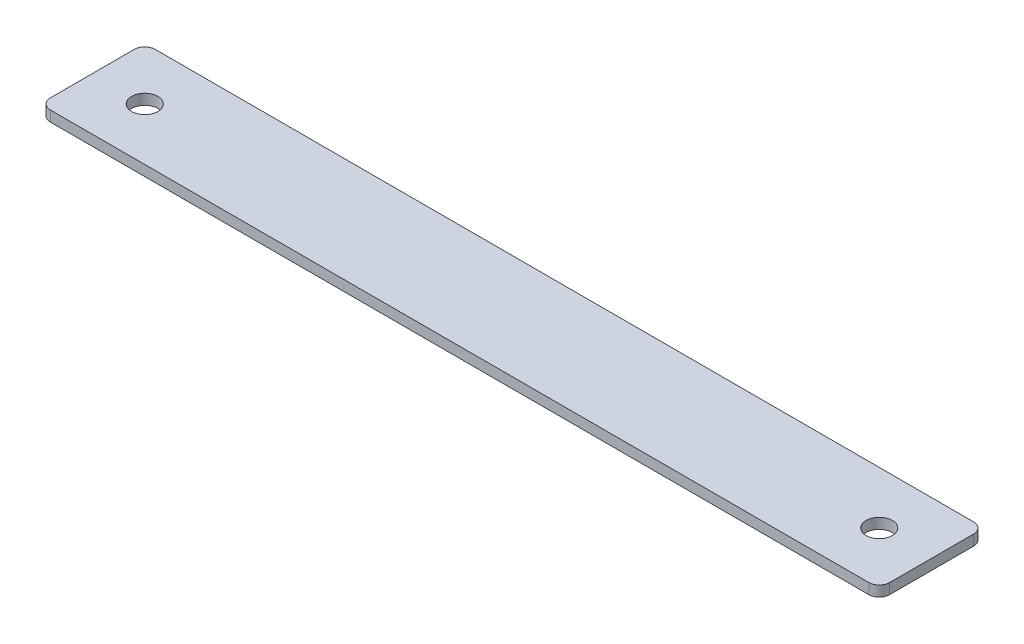
ISO-10303-21;
HEADER;
FILE_DESCRIPTION(('STEP AP214'),'2;1');
FILE_NAME('part.step','',(''),(''),'','','');
FILE_SCHEMA(('AUTOMOTIVE_DESIGN { 1 0 10303 214 1 1 1 1 }'));
ENDSEC;
DATA;
#1=APPLICATION_CONTEXT('core data for automotive mechanical design processes');
#2=APPLICATION_PROTOCOL_DEFINITION('international standard','automotive_design',2000,#1);
#3=PRODUCT_CONTEXT('',#1,'mechanical');
#4=PRODUCT('Part','Part','',(#3));
#5=PRODUCT_RELATED_PRODUCT_CATEGORY('part','',(#4));
#6=PRODUCT_DEFINITION_FORMATION('','',#4);
#7=PRODUCT_DEFINITION_CONTEXT('part definition',#1,'design');
#8=PRODUCT_DEFINITION('design','',#6,#7);
#9=PRODUCT_DEFINITION_SHAPE('','',#8);
#10=(LENGTH_UNIT() NAMED_UNIT(*) SI_UNIT(.MILLI.,.METRE.));
#11=(NAMED_UNIT(*) PLANE_ANGLE_UNIT() SI_UNIT($,.RADIAN.));
#12=(NAMED_UNIT(*) SI_UNIT($,.STERADIAN.) SOLID_ANGLE_UNIT());
#13=UNCERTAINTY_MEASURE_WITH_UNIT(LENGTH_MEASURE(1.E-05),#10,'distance_accuracy_value','');
#14=(GEOMETRIC_REPRESENTATION_CONTEXT(3) GLOBAL_UNCERTAINTY_ASSIGNED_CONTEXT((#13)) GLOBAL_UNIT_ASSIGNED_CONTEXT((#10,
#11,#12)) REPRESENTATION_CONTEXT('',''));
#15=CARTESIAN_POINT('',(0.,0.,0.));
#16=DIRECTION('',(0.,0.,1.));
#17=DIRECTION('',(1.,0.,0.));
#18=AXIS2_PLACEMENT_3D('',#15,#16,#17);
#19=CARTESIAN_POINT('',(78.,-2.,-8.00000000000004));
#20=DIRECTION('',(0.,1.,0.));
#21=DIRECTION('',(0.,0.,1.));
#22=AXIS2_PLACEMENT_3D('',#19,#20,#21);
#23=CYLINDRICAL_SURFACE('',#22,2.);
#24=CARTESIAN_POINT('',(78.,0.,-8.00000000000004));
#25=DIRECTION('',(0.,1.,0.));
#26=DIRECTION('',(0.,0.,-1.));
#27=AXIS2_PLACEMENT_3D('',#24,#25,#26);
#28=CIRCLE('',#27,2.);
#29=CARTESIAN_POINT('',(80.,0.,-8.00000000000003));
#30=VERTEX_POINT('',#29);
#31=CARTESIAN_POINT('',(78.,0.,-10.));
#32=VERTEX_POINT('',#31);
#33=EDGE_CURVE('E135',#30,#32,#28,.T.);
#34=ORIENTED_EDGE('',*,*,#33,.F.);
#35=DIRECTION('',(0.,1.,0.));
#36=VECTOR('',#35,1.);
#37=CARTESIAN_POINT('',(80.,-2.,-8.00000000000003));
#38=LINE('',#37,#36);
#39=CARTESIAN_POINT('',(80.,-2.,-8.00000000000003));
#40=VERTEX_POINT('',#39);
#41=EDGE_CURVE('E11',#40,#30,#38,.T.);
#42=ORIENTED_EDGE('',*,*,#41,.F.);
#43=CARTESIAN_POINT('',(78.,-2.,-8.00000000000004));
#44=DIRECTION('',(0.,1.,0.));
#45=DIRECTION('',(0.,0.,-1.));
#46=AXIS2_PLACEMENT_3D('',#43,#44,#45);
#47=CIRCLE('',#46,2.);
#48=CARTESIAN_POINT('',(78.,-2.,-10.));
#49=VERTEX_POINT('',#48);
#50=EDGE_CURVE('E156',#40,#49,#47,.T.);
#51=ORIENTED_EDGE('',*,*,#50,.T.);
#52=DIRECTION('',(0.,1.,0.));
#53=VECTOR('',#52,1.);
#54=CARTESIAN_POINT('',(78.,-2.,-10.));
#55=LINE('',#54,#53);
#56=EDGE_CURVE('E41',#49,#32,#55,.T.);
#57=ORIENTED_EDGE('',*,*,#56,.T.);
#58=EDGE_LOOP('',(#34,#42,#51,#57));
#59=FACE_BOUND('',#58,.T.);
#60=ADVANCED_FACE('F38',(#59),#23,.T.);
#61=CARTESIAN_POINT('',(80.,-2.,-8.00000000000003));
#62=DIRECTION('',(1.,0.,0.));
#63=DIRECTION('',(0.,0.,-1.));
#64=AXIS2_PLACEMENT_3D('',#61,#62,#63);
#65=PLANE('',#64);
#66=DIRECTION('',(0.,0.,-1.));
#67=VECTOR('',#66,1.);
#68=CARTESIAN_POINT('',(80.,0.,-8.00000000000003));
#69=LINE('',#68,#67);
#70=CARTESIAN_POINT('',(80.,0.,7.99999999999998));
#71=VERTEX_POINT('',#70);
#72=EDGE_CURVE('E154',#71,#30,#69,.T.);
#73=ORIENTED_EDGE('',*,*,#72,.F.);
#74=DIRECTION('',(0.,1.,0.));
#75=VECTOR('',#74,1.);
#76=CARTESIAN_POINT('',(80.,-2.,7.99999999999998));
#77=LINE('',#76,#75);
#78=CARTESIAN_POINT('',(80.,-2.,7.99999999999998));
#79=VERTEX_POINT('',#78);
#80=EDGE_CURVE('E47',#79,#71,#77,.T.);
#81=ORIENTED_EDGE('',*,*,#80,.F.);
#82=DIRECTION('',(0.,0.,-1.));
#83=VECTOR('',#82,1.);
#84=CARTESIAN_POINT('',(80.,-2.,-8.00000000000003));
#85=LINE('',#84,#83);
#86=EDGE_CURVE('E125',#79,#40,#85,.T.);
#87=ORIENTED_EDGE('',*,*,#86,.T.);
#88=ORIENTED_EDGE('',*,*,#41,.T.);
#89=EDGE_LOOP('',(#73,#81,#87,#88));
#90=FACE_BOUND('',#89,.T.);
#91=ADVANCED_FACE('F168',(#90),#65,.T.);
#92=CARTESIAN_POINT('',(78.,-2.,8.));
#93=DIRECTION('',(0.,1.,0.));
#94=DIRECTION('',(0.,0.,1.));
#95=AXIS2_PLACEMENT_3D('',#92,#93,#94);
#96=CYLINDRICAL_SURFACE('',#95,2.);
#97=CARTESIAN_POINT('',(78.,0.,8.));
#98=DIRECTION('',(0.,1.,0.));
#99=DIRECTION('',(0.,0.,-1.));
#100=AXIS2_PLACEMENT_3D('',#97,#98,#99);
#101=CIRCLE('',#100,2.);
#102=CARTESIAN_POINT('',(78.,0.,10.));
#103=VERTEX_POINT('',#102);
#104=EDGE_CURVE('E112',#103,#71,#101,.T.);
#105=ORIENTED_EDGE('',*,*,#104,.F.);
#106=DIRECTION('',(0.,1.,0.));
#107=VECTOR('',#106,1.);
#108=CARTESIAN_POINT('',(78.,-2.,10.));
#109=LINE('',#108,#107);
#110=CARTESIAN_POINT('',(78.,-2.,10.));
#111=VERTEX_POINT('',#110);
#112=EDGE_CURVE('E107',#111,#103,#109,.T.);
#113=ORIENTED_EDGE('',*,*,#112,.F.);
#114=CARTESIAN_POINT('',(78.,-2.,8.));
#115=DIRECTION('',(0.,1.,0.));
#116=DIRECTION('',(0.,0.,-1.));
#117=AXIS2_PLACEMENT_3D('',#114,#115,#116);
#118=CIRCLE('',#117,2.);
#119=EDGE_CURVE('E110',#111,#79,#118,.T.);
#120=ORIENTED_EDGE('',*,*,#119,.T.);
#121=ORIENTED_EDGE('',*,*,#80,.T.);
#122=EDGE_LOOP('',(#105,#113,#120,#121));
#123=FACE_BOUND('',#122,.T.);
#124=ADVANCED_FACE('F109',(#123),#96,.T.);
#125=CARTESIAN_POINT('',(78.,-2.,10.));
#126=DIRECTION('',(0.,0.,1.));
#127=DIRECTION('',(1.,0.,0.));
#128=AXIS2_PLACEMENT_3D('',#125,#126,#127);
#129=PLANE('',#128);
#130=DIRECTION('',(1.,0.,0.));
#131=VECTOR('',#130,1.);
#132=CARTESIAN_POINT('',(78.,0.,10.));
#133=LINE('',#132,#131);
#134=CARTESIAN_POINT('',(-78.,0.,10.));
#135=VERTEX_POINT('',#134);
#136=EDGE_CURVE('E151',#135,#103,#133,.T.);
#137=ORIENTED_EDGE('',*,*,#136,.F.);
#138=DIRECTION('',(0.,1.,0.));
#139=VECTOR('',#138,1.);
#140=CARTESIAN_POINT('',(-78.,-2.,10.));
#141=LINE('',#140,#139);
#142=CARTESIAN_POINT('',(-78.,-2.,10.));
#143=VERTEX_POINT('',#142);
#144=EDGE_CURVE('E117',#143,#135,#141,.T.);
#145=ORIENTED_EDGE('',*,*,#144,.F.);
#146=DIRECTION('',(1.,0.,0.));
#147=VECTOR('',#146,1.);
#148=CARTESIAN_POINT('',(78.,-2.,10.));
#149=LINE('',#148,#147);
#150=EDGE_CURVE('E123',#143,#111,#149,.T.);
#151=ORIENTED_EDGE('',*,*,#150,.T.);
#152=ORIENTED_EDGE('',*,*,#112,.T.);
#153=EDGE_LOOP('',(#137,#145,#151,#152));
#154=FACE_BOUND('',#153,.T.);
#155=ADVANCED_FACE('F127',(#154),#129,.T.);
#156=CARTESIAN_POINT('',(-78.,-2.,8.00000000000002));
#157=DIRECTION('',(0.,1.,0.));
#158=DIRECTION('',(0.,0.,1.));
#159=AXIS2_PLACEMENT_3D('',#156,#157,#158);
#160=CYLINDRICAL_SURFACE('',#159,2.);
#161=CARTESIAN_POINT('',(-78.,0.,8.00000000000002));
#162=DIRECTION('',(0.,1.,0.));
#163=DIRECTION('',(0.,0.,-1.));
#164=AXIS2_PLACEMENT_3D('',#161,#162,#163);
#165=CIRCLE('',#164,2.);
#166=CARTESIAN_POINT('',(-80.,0.,8.00000000000001));
#167=VERTEX_POINT('',#166);
#168=EDGE_CURVE('E148',#167,#135,#165,.T.);
#169=ORIENTED_EDGE('',*,*,#168,.F.);
#170=DIRECTION('',(0.,1.,0.));
#171=VECTOR('',#170,1.);
#172=CARTESIAN_POINT('',(-80.,-2.,8.00000000000001));
#173=LINE('',#172,#171);
#174=CARTESIAN_POINT('',(-80.,-2.,8.00000000000001));
#175=VERTEX_POINT('',#174);
#176=EDGE_CURVE('E160',#175,#167,#173,.T.);
#177=ORIENTED_EDGE('',*,*,#176,.F.);
#178=CARTESIAN_POINT('',(-78.,-2.,8.00000000000002));
#179=DIRECTION('',(0.,1.,0.));
#180=DIRECTION('',(0.,0.,-1.));
#181=AXIS2_PLACEMENT_3D('',#178,#179,#180);
#182=CIRCLE('',#181,2.);
#183=EDGE_CURVE('E128',#175,#143,#182,.T.);
#184=ORIENTED_EDGE('',*,*,#183,.T.);
#185=ORIENTED_EDGE('',*,*,#144,.T.);
#186=EDGE_LOOP('',(#169,#177,#184,#185));
#187=FACE_BOUND('',#186,.T.);
#188=ADVANCED_FACE('F181',(#187),#160,.T.);
#189=CARTESIAN_POINT('',(-80.,-2.,8.00000000000001));
#190=DIRECTION('',(-1.,0.,0.));
#191=DIRECTION('',(0.,0.,1.));
#192=AXIS2_PLACEMENT_3D('',#189,#190,#191);
#193=PLANE('',#192);
#194=DIRECTION('',(0.,0.,1.));
#195=VECTOR('',#194,1.);
#196=CARTESIAN_POINT('',(-80.,0.,8.00000000000001));
#197=LINE('',#196,#195);
#198=CARTESIAN_POINT('',(-80.,0.,-8.00000000000001));
#199=VERTEX_POINT('',#198);
#200=EDGE_CURVE('E145',#199,#167,#197,.T.);
#201=ORIENTED_EDGE('',*,*,#200,.F.);
#202=DIRECTION('',(0.,1.,0.));
#203=VECTOR('',#202,1.);
#204=CARTESIAN_POINT('',(-80.,-2.,-8.00000000000001));
#205=LINE('',#204,#203);
#206=CARTESIAN_POINT('',(-80.,-2.,-8.00000000000001));
#207=VERTEX_POINT('',#206);
#208=EDGE_CURVE('E162',#207,#199,#205,.T.);
#209=ORIENTED_EDGE('',*,*,#208,.F.);
#210=DIRECTION('',(0.,0.,1.));
#211=VECTOR('',#210,1.);
#212=CARTESIAN_POINT('',(-80.,-2.,8.00000000000001));
#213=LINE('',#212,#211);
#214=EDGE_CURVE('E130',#207,#175,#213,.T.);
#215=ORIENTED_EDGE('',*,*,#214,.T.);
#216=ORIENTED_EDGE('',*,*,#176,.T.);
#217=EDGE_LOOP('',(#201,#209,#215,#216));
#218=FACE_BOUND('',#217,.T.);
#219=ADVANCED_FACE('F184',(#218),#193,.T.);
#220=CARTESIAN_POINT('',(-78.,-2.,-8.00000000000002));
#221=DIRECTION('',(0.,1.,0.));
#222=DIRECTION('',(0.,0.,1.));
#223=AXIS2_PLACEMENT_3D('',#220,#221,#222);
#224=CYLINDRICAL_SURFACE('',#223,2.);
#225=CARTESIAN_POINT('',(-78.,0.,-8.00000000000002));
#226=DIRECTION('',(0.,1.,0.));
#227=DIRECTION('',(0.,0.,1.));
#228=AXIS2_PLACEMENT_3D('',#225,#226,#227);
#229=CIRCLE('',#228,2.);
#230=CARTESIAN_POINT('',(-78.,0.,-10.));
#231=VERTEX_POINT('',#230);
#232=EDGE_CURVE('E142',#231,#199,#229,.T.);
#233=ORIENTED_EDGE('',*,*,#232,.F.);
#234=DIRECTION('',(0.,1.,0.));
#235=VECTOR('',#234,1.);
#236=CARTESIAN_POINT('',(-78.,-2.,-10.));
#237=LINE('',#236,#235);
#238=CARTESIAN_POINT('',(-78.,-2.,-10.));
#239=VERTEX_POINT('',#238);
#240=EDGE_CURVE('E163',#239,#231,#237,.T.);
#241=ORIENTED_EDGE('',*,*,#240,.F.);
#242=CARTESIAN_POINT('',(-78.,-2.,-8.00000000000002));
#243=DIRECTION('',(0.,1.,0.));
#244=DIRECTION('',(0.,0.,1.));
#245=AXIS2_PLACEMENT_3D('',#242,#243,#244);
#246=CIRCLE('',#245,2.);
#247=EDGE_CURVE('E230',#239,#207,#246,.T.);
#248=ORIENTED_EDGE('',*,*,#247,.T.);
#249=ORIENTED_EDGE('',*,*,#208,.T.);
#250=EDGE_LOOP('',(#233,#241,#248,#249));
#251=FACE_BOUND('',#250,.T.);
#252=ADVANCED_FACE('F188',(#251),#224,.T.);
#253=CARTESIAN_POINT('',(-78.,-2.,-10.));
#254=DIRECTION('',(0.,0.,-1.));
#255=DIRECTION('',(-1.,0.,0.));
#256=AXIS2_PLACEMENT_3D('',#253,#254,#255);
#257=PLANE('',#256);
#258=DIRECTION('',(-1.,0.,0.));
#259=VECTOR('',#258,1.);
#260=CARTESIAN_POINT('',(-78.,0.,-10.));
#261=LINE('',#260,#259);
#262=EDGE_CURVE('E138',#32,#231,#261,.T.);
#263=ORIENTED_EDGE('',*,*,#262,.F.);
#264=ORIENTED_EDGE('',*,*,#56,.F.);
#265=DIRECTION('',(-1.,0.,0.));
#266=VECTOR('',#265,1.);
#267=CARTESIAN_POINT('',(-78.,-2.,-10.));
#268=LINE('',#267,#266);
#269=EDGE_CURVE('E228',#49,#239,#268,.T.);
#270=ORIENTED_EDGE('',*,*,#269,.T.);
#271=ORIENTED_EDGE('',*,*,#240,.T.);
#272=EDGE_LOOP('',(#263,#264,#270,#271));
#273=FACE_BOUND('',#272,.T.);
#274=ADVANCED_FACE('F165',(#273),#257,.T.);
#275=CARTESIAN_POINT('',(78.,-2.,-8.00000000000004));
#276=DIRECTION('',(0.,-1.,0.));
#277=DIRECTION('',(0.,0.,-1.));
#278=AXIS2_PLACEMENT_3D('',#275,#276,#277);
#279=PLANE('',#278);
#280=CARTESIAN_POINT('',(70.,-2.,0.));
#281=DIRECTION('',(0.,1.,0.));
#282=DIRECTION('',(0.,0.,1.));
#283=AXIS2_PLACEMENT_3D('',#280,#281,#282);
#284=CIRCLE('',#283,2.50000000000001);
#285=CARTESIAN_POINT('',(70.,-2.,2.49999999999999));
#286=VERTEX_POINT('',#285);
#287=EDGE_CURVE('E215',#286,#286,#284,.T.);
#288=ORIENTED_EDGE('',*,*,#287,.T.);
#289=EDGE_LOOP('',(#288));
#290=FACE_BOUND('',#289,.T.);
#291=CARTESIAN_POINT('',(-70.,-2.,0.));
#292=DIRECTION('',(0.,1.,0.));
#293=DIRECTION('',(0.,0.,1.));
#294=AXIS2_PLACEMENT_3D('',#291,#292,#293);
#295=CIRCLE('',#294,2.50000000000001);
#296=CARTESIAN_POINT('',(-70.,-2.,2.50000000000001));
#297=VERTEX_POINT('',#296);
#298=EDGE_CURVE('E139',#297,#297,#295,.T.);
#299=ORIENTED_EDGE('',*,*,#298,.T.);
#300=EDGE_LOOP('',(#299));
#301=FACE_BOUND('',#300,.T.);
#302=ORIENTED_EDGE('',*,*,#50,.F.);
#303=ORIENTED_EDGE('',*,*,#86,.F.);
#304=ORIENTED_EDGE('',*,*,#119,.F.);
#305=ORIENTED_EDGE('',*,*,#150,.F.);
#306=ORIENTED_EDGE('',*,*,#183,.F.);
#307=ORIENTED_EDGE('',*,*,#214,.F.);
#308=ORIENTED_EDGE('',*,*,#247,.F.);
#309=ORIENTED_EDGE('',*,*,#269,.F.);
#310=EDGE_LOOP('',(#302,#303,#304,#305,#306,#307,#308,#309));
#311=FACE_BOUND('',#310,.T.);
#312=ADVANCED_FACE('F121',(#290,#301,#311),#279,.T.);
#313=CARTESIAN_POINT('',(78.,0.,-8.00000000000004));
#314=DIRECTION('',(0.,-1.,0.));
#315=DIRECTION('',(0.,0.,-1.));
#316=AXIS2_PLACEMENT_3D('',#313,#314,#315);
#317=PLANE('',#316);
#318=CARTESIAN_POINT('',(70.,0.,0.));
#319=DIRECTION('',(0.,1.,0.));
#320=DIRECTION('',(0.,0.,1.));
#321=AXIS2_PLACEMENT_3D('',#318,#319,#320);
#322=CIRCLE('',#321,2.50000000000001);
#323=CARTESIAN_POINT('',(70.,0.,2.49999999999999));
#324=VERTEX_POINT('',#323);
#325=EDGE_CURVE('E218',#324,#324,#322,.T.);
#326=ORIENTED_EDGE('',*,*,#325,.F.);
#327=EDGE_LOOP('',(#326));
#328=FACE_BOUND('',#327,.T.);
#329=CARTESIAN_POINT('',(-70.,0.,0.));
#330=DIRECTION('',(0.,1.,0.));
#331=DIRECTION('',(0.,0.,1.));
#332=AXIS2_PLACEMENT_3D('',#329,#330,#331);
#333=CIRCLE('',#332,2.50000000000001);
#334=CARTESIAN_POINT('',(-70.,0.,2.50000000000001));
#335=VERTEX_POINT('',#334);
#336=EDGE_CURVE('E220',#335,#335,#333,.T.);
#337=ORIENTED_EDGE('',*,*,#336,.F.);
#338=EDGE_LOOP('',(#337));
#339=FACE_BOUND('',#338,.T.);
#340=ORIENTED_EDGE('',*,*,#33,.T.);
#341=ORIENTED_EDGE('',*,*,#262,.T.);
#342=ORIENTED_EDGE('',*,*,#232,.T.);
#343=ORIENTED_EDGE('',*,*,#200,.T.);
#344=ORIENTED_EDGE('',*,*,#168,.T.);
#345=ORIENTED_EDGE('',*,*,#136,.T.);
#346=ORIENTED_EDGE('',*,*,#104,.T.);
#347=ORIENTED_EDGE('',*,*,#72,.T.);
#348=EDGE_LOOP('',(#340,#341,#342,#343,#344,#345,#346,#347));
#349=FACE_BOUND('',#348,.T.);
#350=ADVANCED_FACE('F167',(#328,#339,#349),#317,.F.);
#351=CARTESIAN_POINT('',(-70.,-2.,0.));
#352=DIRECTION('',(0.,1.,0.));
#353=DIRECTION('',(0.,0.,1.));
#354=AXIS2_PLACEMENT_3D('',#351,#352,#353);
#355=CYLINDRICAL_SURFACE('',#354,2.50000000000001);
#356=ORIENTED_EDGE('',*,*,#298,.F.);
#357=EDGE_LOOP('',(#356));
#358=FACE_BOUND('',#357,.T.);
#359=ORIENTED_EDGE('',*,*,#336,.T.);
#360=EDGE_LOOP('',(#359));
#361=FACE_BOUND('',#360,.T.);
#362=ADVANCED_FACE('F200',(#358,#361),#355,.F.);
#363=CARTESIAN_POINT('',(70.,-2.,0.));
#364=DIRECTION('',(0.,1.,0.));
#365=DIRECTION('',(0.,0.,1.));
#366=AXIS2_PLACEMENT_3D('',#363,#364,#365);
#367=CYLINDRICAL_SURFACE('',#366,2.50000000000001);
#368=ORIENTED_EDGE('',*,*,#287,.F.);
#369=EDGE_LOOP('',(#368));
#370=FACE_BOUND('',#369,.T.);
#371=ORIENTED_EDGE('',*,*,#325,.T.);
#372=EDGE_LOOP('',(#371));
#373=FACE_BOUND('',#372,.T.);
#374=ADVANCED_FACE('F207',(#370,#373),#367,.F.);
#375=CLOSED_SHELL('',(#60,#91,#124,#155,#188,#219,#252,#274,#312,#350,#362,#374));
#376=MANIFOLD_SOLID_BREP('B2',#375);
#377=ADVANCED_BREP_SHAPE_REPRESENTATION('',(#18,#376),#14);
#378=SHAPE_DEFINITION_REPRESENTATION(#9,#377);
ENDSEC;
END-ISO-10303-21;
